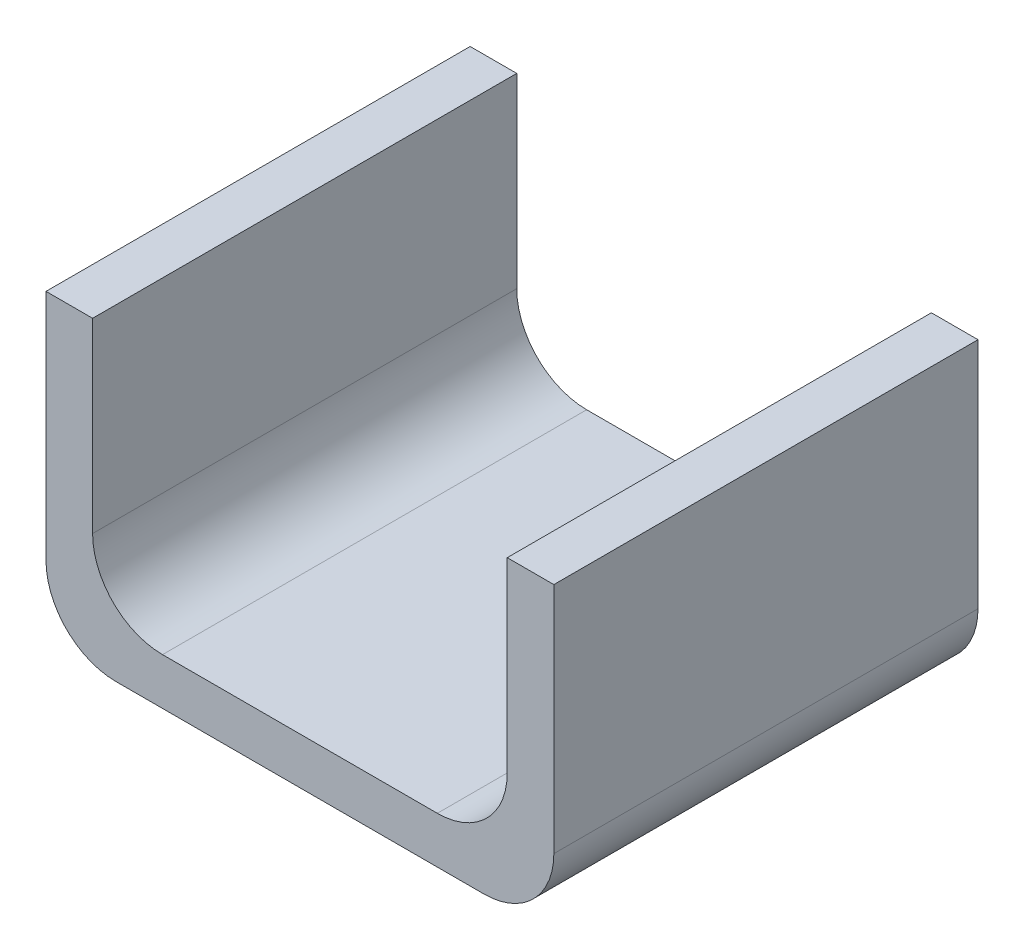
ISO-10303-21;
HEADER;
FILE_DESCRIPTION(('STEP AP214'),'2;1');
FILE_NAME('part.step','',(''),(''),'','','');
FILE_SCHEMA(('AUTOMOTIVE_DESIGN { 1 0 10303 214 1 1 1 1 }'));
ENDSEC;
DATA;
#1=APPLICATION_CONTEXT('core data for automotive mechanical design processes');
#2=APPLICATION_PROTOCOL_DEFINITION('international standard','automotive_design',2000,#1);
#3=PRODUCT_CONTEXT('',#1,'mechanical');
#4=PRODUCT('Part','Part','',(#3));
#5=PRODUCT_RELATED_PRODUCT_CATEGORY('part','',(#4));
#6=PRODUCT_DEFINITION_FORMATION('','',#4);
#7=PRODUCT_DEFINITION_CONTEXT('part definition',#1,'design');
#8=PRODUCT_DEFINITION('design','',#6,#7);
#9=PRODUCT_DEFINITION_SHAPE('','',#8);
#10=(LENGTH_UNIT() NAMED_UNIT(*) SI_UNIT(.MILLI.,.METRE.));
#11=(NAMED_UNIT(*) PLANE_ANGLE_UNIT() SI_UNIT($,.RADIAN.));
#12=(NAMED_UNIT(*) SI_UNIT($,.STERADIAN.) SOLID_ANGLE_UNIT());
#13=UNCERTAINTY_MEASURE_WITH_UNIT(LENGTH_MEASURE(1.E-05),#10,'distance_accuracy_value','');
#14=(GEOMETRIC_REPRESENTATION_CONTEXT(3) GLOBAL_UNCERTAINTY_ASSIGNED_CONTEXT((#13)) GLOBAL_UNIT_ASSIGNED_CONTEXT((#10,
#11,#12)) REPRESENTATION_CONTEXT('',''));
#15=CARTESIAN_POINT('',(0.,0.,0.));
#16=DIRECTION('',(0.,0.,1.));
#17=DIRECTION('',(1.,0.,0.));
#18=AXIS2_PLACEMENT_3D('',#15,#16,#17);
#19=CARTESIAN_POINT('',(0.,2.,0.));
#20=DIRECTION('',(0.,1.,0.));
#21=DIRECTION('',(0.,0.,1.));
#22=AXIS2_PLACEMENT_3D('',#19,#20,#21);
#23=PLANE('',#22);
#24=DIRECTION('',(1.,0.,0.));
#25=VECTOR('',#24,1.);
#26=CARTESIAN_POINT('',(0.,2.,-6.84486778890001));
#27=LINE('',#26,#25);
#28=CARTESIAN_POINT('',(-5.93009682212145,2.,-6.84486778890001));
#29=VERTEX_POINT('',#28);
#30=CARTESIAN_POINT('',(5.86230684431357,2.,-6.84486778890001));
#31=VERTEX_POINT('',#30);
#32=EDGE_CURVE('E173',#29,#31,#27,.T.);
#33=ORIENTED_EDGE('',*,*,#32,.F.);
#34=DIRECTION('',(0.,0.,-1.));
#35=VECTOR('',#34,1.);
#36=CARTESIAN_POINT('',(-5.93009682212145,2.,11.3561660837375));
#37=LINE('',#36,#35);
#38=CARTESIAN_POINT('',(-5.93009682212145,2.,11.3561660837375));
#39=VERTEX_POINT('',#38);
#40=EDGE_CURVE('E214',#29,#39,#37,.F.);
#41=ORIENTED_EDGE('',*,*,#40,.T.);
#42=DIRECTION('',(1.,0.,0.));
#43=VECTOR('',#42,1.);
#44=CARTESIAN_POINT('',(0.,2.,11.3561660837375));
#45=LINE('',#44,#43);
#46=CARTESIAN_POINT('',(5.86230684431357,2.,11.3561660837375));
#47=VERTEX_POINT('',#46);
#48=EDGE_CURVE('E170',#39,#47,#45,.T.);
#49=ORIENTED_EDGE('',*,*,#48,.T.);
#50=DIRECTION('',(0.,0.,-1.));
#51=VECTOR('',#50,1.);
#52=CARTESIAN_POINT('',(5.86230684431357,2.,0.));
#53=LINE('',#52,#51);
#54=EDGE_CURVE('E212',#47,#31,#53,.T.);
#55=ORIENTED_EDGE('',*,*,#54,.T.);
#56=EDGE_LOOP('',(#33,#41,#49,#55));
#57=FACE_BOUND('',#56,.T.);
#58=ADVANCED_FACE('F39',(#57),#23,.T.);
#59=CARTESIAN_POINT('',(0.,2.,11.3561660837375));
#60=DIRECTION('',(0.,0.,-1.));
#61=DIRECTION('',(-1.,0.,0.));
#62=AXIS2_PLACEMENT_3D('',#59,#60,#61);
#63=PLANE('',#62);
#64=DIRECTION('',(0.,-1.,0.));
#65=VECTOR('',#64,1.);
#66=CARTESIAN_POINT('',(-10.9300968221214,2.,11.3561660837375));
#67=LINE('',#66,#65);
#68=CARTESIAN_POINT('',(-10.9300968221214,13.,11.3561660837375));
#69=VERTEX_POINT('',#68);
#70=CARTESIAN_POINT('',(-10.9300968221214,3.,11.3561660837375));
#71=VERTEX_POINT('',#70);
#72=EDGE_CURVE('E176',#69,#71,#67,.T.);
#73=ORIENTED_EDGE('',*,*,#72,.T.);
#74=CARTESIAN_POINT('',(-7.93009682212144,3.,11.3561660837375));
#75=DIRECTION('',(0.,0.,-1.));
#76=DIRECTION('',(-1.,0.,0.));
#77=AXIS2_PLACEMENT_3D('',#74,#75,#76);
#78=CIRCLE('',#77,3.);
#79=CARTESIAN_POINT('',(-7.93009682212144,0.,11.3561660837375));
#80=VERTEX_POINT('',#79);
#81=EDGE_CURVE('E196',#71,#80,#78,.F.);
#82=ORIENTED_EDGE('',*,*,#81,.T.);
#83=DIRECTION('',(1.,0.,0.));
#84=VECTOR('',#83,1.);
#85=CARTESIAN_POINT('',(0.,0.,11.3561660837375));
#86=LINE('',#85,#84);
#87=CARTESIAN_POINT('',(7.86230684431357,0.,11.3561660837375));
#88=VERTEX_POINT('',#87);
#89=EDGE_CURVE('E169',#80,#88,#86,.T.);
#90=ORIENTED_EDGE('',*,*,#89,.T.);
#91=CARTESIAN_POINT('',(7.86230684431357,3.,11.3561660837375));
#92=DIRECTION('',(0.,0.,-1.));
#93=DIRECTION('',(-1.,0.,0.));
#94=AXIS2_PLACEMENT_3D('',#91,#92,#93);
#95=CIRCLE('',#94,3.);
#96=CARTESIAN_POINT('',(10.8623068443136,3.,11.3561660837375));
#97=VERTEX_POINT('',#96);
#98=EDGE_CURVE('E194',#88,#97,#95,.F.);
#99=ORIENTED_EDGE('',*,*,#98,.T.);
#100=DIRECTION('',(0.,-1.,0.));
#101=VECTOR('',#100,1.);
#102=CARTESIAN_POINT('',(10.8623068443136,2.,11.3561660837375));
#103=LINE('',#102,#101);
#104=CARTESIAN_POINT('',(10.8623068443136,13.,11.3561660837375));
#105=VERTEX_POINT('',#104);
#106=EDGE_CURVE('E188',#105,#97,#103,.T.);
#107=ORIENTED_EDGE('',*,*,#106,.F.);
#108=DIRECTION('',(1.,0.,0.));
#109=VECTOR('',#108,1.);
#110=CARTESIAN_POINT('',(0.,13.,11.3561660837375));
#111=LINE('',#110,#109);
#112=CARTESIAN_POINT('',(8.86230684431357,13.,11.3561660837375));
#113=VERTEX_POINT('',#112);
#114=EDGE_CURVE('E143',#113,#105,#111,.T.);
#115=ORIENTED_EDGE('',*,*,#114,.F.);
#116=DIRECTION('',(0.,-1.,0.));
#117=VECTOR('',#116,1.);
#118=CARTESIAN_POINT('',(8.86230684431357,13.,11.3561660837375));
#119=LINE('',#118,#117);
#120=CARTESIAN_POINT('',(8.86230684431357,5.,11.3561660837375));
#121=VERTEX_POINT('',#120);
#122=EDGE_CURVE('E134',#113,#121,#119,.T.);
#123=ORIENTED_EDGE('',*,*,#122,.T.);
#124=CARTESIAN_POINT('',(5.86230684431357,5.,11.3561660837375));
#125=DIRECTION('',(0.,0.,-1.));
#126=DIRECTION('',(-1.,0.,0.));
#127=AXIS2_PLACEMENT_3D('',#124,#125,#126);
#128=CIRCLE('',#127,3.);
#129=EDGE_CURVE('E11',#121,#47,#128,.T.);
#130=ORIENTED_EDGE('',*,*,#129,.T.);
#131=ORIENTED_EDGE('',*,*,#48,.F.);
#132=CARTESIAN_POINT('',(-5.93009682212145,5.,11.3561660837375));
#133=DIRECTION('',(0.,0.,-1.));
#134=DIRECTION('',(-1.,0.,0.));
#135=AXIS2_PLACEMENT_3D('',#132,#133,#134);
#136=CIRCLE('',#135,3.);
#137=CARTESIAN_POINT('',(-8.93009682212144,5.,11.3561660837375));
#138=VERTEX_POINT('',#137);
#139=EDGE_CURVE('E220',#39,#138,#136,.T.);
#140=ORIENTED_EDGE('',*,*,#139,.T.);
#141=DIRECTION('',(0.,-1.,0.));
#142=VECTOR('',#141,1.);
#143=CARTESIAN_POINT('',(-8.93009682212144,13.,11.3561660837375));
#144=LINE('',#143,#142);
#145=CARTESIAN_POINT('',(-8.93009682212144,13.,11.3561660837375));
#146=VERTEX_POINT('',#145);
#147=EDGE_CURVE('E166',#146,#138,#144,.T.);
#148=ORIENTED_EDGE('',*,*,#147,.F.);
#149=DIRECTION('',(1.,0.,0.));
#150=VECTOR('',#149,1.);
#151=CARTESIAN_POINT('',(0.,13.,11.3561660837375));
#152=LINE('',#151,#150);
#153=EDGE_CURVE('E155',#69,#146,#152,.T.);
#154=ORIENTED_EDGE('',*,*,#153,.F.);
#155=EDGE_LOOP('',(#73,#82,#90,#99,#107,#115,#123,#130,#131,#140,#148,#154));
#156=FACE_BOUND('',#155,.T.);
#157=ADVANCED_FACE('F225',(#156),#63,.F.);
#158=CARTESIAN_POINT('',(10.8623068443136,2.,0.));
#159=DIRECTION('',(1.,0.,0.));
#160=DIRECTION('',(0.,0.,-1.));
#161=AXIS2_PLACEMENT_3D('',#158,#159,#160);
#162=PLANE('',#161);
#163=ORIENTED_EDGE('',*,*,#106,.T.);
#164=DIRECTION('',(0.,0.,1.));
#165=VECTOR('',#164,1.);
#166=CARTESIAN_POINT('',(10.8623068443136,3.,-6.84486778890001));
#167=LINE('',#166,#165);
#168=CARTESIAN_POINT('',(10.8623068443136,3.,-6.84486778890001));
#169=VERTEX_POINT('',#168);
#170=EDGE_CURVE('E207',#97,#169,#167,.F.);
#171=ORIENTED_EDGE('',*,*,#170,.T.);
#172=DIRECTION('',(0.,-1.,0.));
#173=VECTOR('',#172,1.);
#174=CARTESIAN_POINT('',(10.8623068443136,2.,-6.84486778890001));
#175=LINE('',#174,#173);
#176=CARTESIAN_POINT('',(10.8623068443136,13.,-6.84486778890001));
#177=VERTEX_POINT('',#176);
#178=EDGE_CURVE('E186',#177,#169,#175,.T.);
#179=ORIENTED_EDGE('',*,*,#178,.F.);
#180=DIRECTION('',(0.,0.,1.));
#181=VECTOR('',#180,1.);
#182=CARTESIAN_POINT('',(10.8623068443136,13.,0.));
#183=LINE('',#182,#181);
#184=EDGE_CURVE('E147',#177,#105,#183,.T.);
#185=ORIENTED_EDGE('',*,*,#184,.T.);
#186=EDGE_LOOP('',(#163,#171,#179,#185));
#187=FACE_BOUND('',#186,.T.);
#188=ADVANCED_FACE('F238',(#187),#162,.T.);
#189=CARTESIAN_POINT('',(0.,2.,-6.84486778890001));
#190=DIRECTION('',(0.,0.,-1.));
#191=DIRECTION('',(-1.,0.,0.));
#192=AXIS2_PLACEMENT_3D('',#189,#190,#191);
#193=PLANE('',#192);
#194=DIRECTION('',(1.,0.,0.));
#195=VECTOR('',#194,1.);
#196=CARTESIAN_POINT('',(0.,0.,-6.84486778890001));
#197=LINE('',#196,#195);
#198=CARTESIAN_POINT('',(-7.93009682212144,0.,-6.84486778890001));
#199=VERTEX_POINT('',#198);
#200=CARTESIAN_POINT('',(7.86230684431357,0.,-6.84486778890001));
#201=VERTEX_POINT('',#200);
#202=EDGE_CURVE('E174',#199,#201,#197,.T.);
#203=ORIENTED_EDGE('',*,*,#202,.F.);
#204=CARTESIAN_POINT('',(-7.93009682212144,3.,-6.84486778890001));
#205=DIRECTION('',(0.,0.,-1.));
#206=DIRECTION('',(-1.,0.,0.));
#207=AXIS2_PLACEMENT_3D('',#204,#205,#206);
#208=CIRCLE('',#207,3.);
#209=CARTESIAN_POINT('',(-10.9300968221214,3.,-6.84486778890001));
#210=VERTEX_POINT('',#209);
#211=EDGE_CURVE('E205',#199,#210,#208,.T.);
#212=ORIENTED_EDGE('',*,*,#211,.T.);
#213=DIRECTION('',(0.,-1.,0.));
#214=VECTOR('',#213,1.);
#215=CARTESIAN_POINT('',(-10.9300968221214,2.,-6.84486778890001));
#216=LINE('',#215,#214);
#217=CARTESIAN_POINT('',(-10.9300968221214,13.,-6.84486778890001));
#218=VERTEX_POINT('',#217);
#219=EDGE_CURVE('E183',#218,#210,#216,.T.);
#220=ORIENTED_EDGE('',*,*,#219,.F.);
#221=DIRECTION('',(1.,0.,0.));
#222=VECTOR('',#221,1.);
#223=CARTESIAN_POINT('',(0.,13.,-6.84486778890001));
#224=LINE('',#223,#222);
#225=CARTESIAN_POINT('',(-8.93009682212145,13.,-6.84486778890001));
#226=VERTEX_POINT('',#225);
#227=EDGE_CURVE('E160',#218,#226,#224,.T.);
#228=ORIENTED_EDGE('',*,*,#227,.T.);
#229=DIRECTION('',(0.,-1.,0.));
#230=VECTOR('',#229,1.);
#231=CARTESIAN_POINT('',(-8.93009682212145,13.,-6.84486778890001));
#232=LINE('',#231,#230);
#233=CARTESIAN_POINT('',(-8.93009682212145,5.,-6.84486778890001));
#234=VERTEX_POINT('',#233);
#235=EDGE_CURVE('E163',#226,#234,#232,.T.);
#236=ORIENTED_EDGE('',*,*,#235,.T.);
#237=CARTESIAN_POINT('',(-5.93009682212145,5.,-6.84486778890001));
#238=DIRECTION('',(0.,0.,-1.));
#239=DIRECTION('',(-1.,0.,0.));
#240=AXIS2_PLACEMENT_3D('',#237,#238,#239);
#241=CIRCLE('',#240,3.);
#242=EDGE_CURVE('E218',#234,#29,#241,.F.);
#243=ORIENTED_EDGE('',*,*,#242,.T.);
#244=ORIENTED_EDGE('',*,*,#32,.T.);
#245=CARTESIAN_POINT('',(5.86230684431357,5.,-6.84486778890001));
#246=DIRECTION('',(0.,0.,-1.));
#247=DIRECTION('',(-1.,0.,0.));
#248=AXIS2_PLACEMENT_3D('',#245,#246,#247);
#249=CIRCLE('',#248,3.);
#250=CARTESIAN_POINT('',(8.86230684431357,5.,-6.84486778890001));
#251=VERTEX_POINT('',#250);
#252=EDGE_CURVE('E47',#31,#251,#249,.F.);
#253=ORIENTED_EDGE('',*,*,#252,.T.);
#254=DIRECTION('',(0.,-1.,0.));
#255=VECTOR('',#254,1.);
#256=CARTESIAN_POINT('',(8.86230684431357,13.,-6.84486778890001));
#257=LINE('',#256,#255);
#258=CARTESIAN_POINT('',(8.86230684431357,13.,-6.84486778890001));
#259=VERTEX_POINT('',#258);
#260=EDGE_CURVE('E124',#259,#251,#257,.T.);
#261=ORIENTED_EDGE('',*,*,#260,.F.);
#262=DIRECTION('',(1.,0.,0.));
#263=VECTOR('',#262,1.);
#264=CARTESIAN_POINT('',(0.,13.,-6.84486778890001));
#265=LINE('',#264,#263);
#266=EDGE_CURVE('E130',#259,#177,#265,.T.);
#267=ORIENTED_EDGE('',*,*,#266,.T.);
#268=ORIENTED_EDGE('',*,*,#178,.T.);
#269=CARTESIAN_POINT('',(7.86230684431357,3.,-6.84486778890001));
#270=DIRECTION('',(0.,0.,-1.));
#271=DIRECTION('',(-1.,0.,0.));
#272=AXIS2_PLACEMENT_3D('',#269,#270,#271);
#273=CIRCLE('',#272,3.);
#274=EDGE_CURVE('E203',#169,#201,#273,.T.);
#275=ORIENTED_EDGE('',*,*,#274,.T.);
#276=EDGE_LOOP('',(#203,#212,#220,#228,#236,#243,#244,#253,#261,#267,#268,#275));
#277=FACE_BOUND('',#276,.T.);
#278=ADVANCED_FACE('F127',(#277),#193,.T.);
#279=CARTESIAN_POINT('',(-10.9300968221214,2.,0.));
#280=DIRECTION('',(1.,0.,0.));
#281=DIRECTION('',(0.,0.,-1.));
#282=AXIS2_PLACEMENT_3D('',#279,#280,#281);
#283=PLANE('',#282);
#284=ORIENTED_EDGE('',*,*,#219,.T.);
#285=DIRECTION('',(0.,0.,1.));
#286=VECTOR('',#285,1.);
#287=CARTESIAN_POINT('',(-10.9300968221214,3.,0.));
#288=LINE('',#287,#286);
#289=EDGE_CURVE('E191',#210,#71,#288,.T.);
#290=ORIENTED_EDGE('',*,*,#289,.T.);
#291=ORIENTED_EDGE('',*,*,#72,.F.);
#292=DIRECTION('',(0.,0.,1.));
#293=VECTOR('',#292,1.);
#294=CARTESIAN_POINT('',(-10.9300968221214,13.,0.));
#295=LINE('',#294,#293);
#296=EDGE_CURVE('E133',#218,#69,#295,.T.);
#297=ORIENTED_EDGE('',*,*,#296,.F.);
#298=EDGE_LOOP('',(#284,#290,#291,#297));
#299=FACE_BOUND('',#298,.T.);
#300=ADVANCED_FACE('F253',(#299),#283,.F.);
#301=CARTESIAN_POINT('',(0.,0.,0.));
#302=DIRECTION('',(0.,1.,0.));
#303=DIRECTION('',(0.,0.,1.));
#304=AXIS2_PLACEMENT_3D('',#301,#302,#303);
#305=PLANE('',#304);
#306=ORIENTED_EDGE('',*,*,#89,.F.);
#307=DIRECTION('',(0.,0.,1.));
#308=VECTOR('',#307,1.);
#309=CARTESIAN_POINT('',(-7.93009682212144,0.,0.));
#310=LINE('',#309,#308);
#311=EDGE_CURVE('E201',#80,#199,#310,.F.);
#312=ORIENTED_EDGE('',*,*,#311,.T.);
#313=ORIENTED_EDGE('',*,*,#202,.T.);
#314=DIRECTION('',(0.,0.,1.));
#315=VECTOR('',#314,1.);
#316=CARTESIAN_POINT('',(7.86230684431357,0.,11.3561660837375));
#317=LINE('',#316,#315);
#318=EDGE_CURVE('E198',#201,#88,#317,.T.);
#319=ORIENTED_EDGE('',*,*,#318,.T.);
#320=EDGE_LOOP('',(#306,#312,#313,#319));
#321=FACE_BOUND('',#320,.T.);
#322=ADVANCED_FACE('F246',(#321),#305,.F.);
#323=CARTESIAN_POINT('',(-8.93009682212145,13.,0.));
#324=DIRECTION('',(1.,0.,0.));
#325=DIRECTION('',(0.,0.,-1.));
#326=AXIS2_PLACEMENT_3D('',#323,#324,#325);
#327=PLANE('',#326);
#328=ORIENTED_EDGE('',*,*,#147,.T.);
#329=DIRECTION('',(0.,0.,-1.));
#330=VECTOR('',#329,1.);
#331=CARTESIAN_POINT('',(-8.93009682212145,5.,-6.84486778890001));
#332=LINE('',#331,#330);
#333=EDGE_CURVE('E209',#138,#234,#332,.T.);
#334=ORIENTED_EDGE('',*,*,#333,.T.);
#335=ORIENTED_EDGE('',*,*,#235,.F.);
#336=DIRECTION('',(0.,0.,1.));
#337=VECTOR('',#336,1.);
#338=CARTESIAN_POINT('',(-8.93009682212145,13.,0.));
#339=LINE('',#338,#337);
#340=EDGE_CURVE('E157',#226,#146,#339,.T.);
#341=ORIENTED_EDGE('',*,*,#340,.T.);
#342=EDGE_LOOP('',(#328,#334,#335,#341));
#343=FACE_BOUND('',#342,.T.);
#344=ADVANCED_FACE('F231',(#343),#327,.T.);
#345=CARTESIAN_POINT('',(0.,13.,0.));
#346=DIRECTION('',(0.,1.,0.));
#347=DIRECTION('',(0.,0.,1.));
#348=AXIS2_PLACEMENT_3D('',#345,#346,#347);
#349=PLANE('',#348);
#350=ORIENTED_EDGE('',*,*,#296,.T.);
#351=ORIENTED_EDGE('',*,*,#153,.T.);
#352=ORIENTED_EDGE('',*,*,#340,.F.);
#353=ORIENTED_EDGE('',*,*,#227,.F.);
#354=EDGE_LOOP('',(#350,#351,#352,#353));
#355=FACE_BOUND('',#354,.T.);
#356=ADVANCED_FACE('F257',(#355),#349,.T.);
#357=CARTESIAN_POINT('',(8.86230684431357,13.,0.));
#358=DIRECTION('',(1.,0.,0.));
#359=DIRECTION('',(0.,0.,-1.));
#360=AXIS2_PLACEMENT_3D('',#357,#358,#359);
#361=PLANE('',#360);
#362=ORIENTED_EDGE('',*,*,#260,.T.);
#363=DIRECTION('',(0.,0.,-1.));
#364=VECTOR('',#363,1.);
#365=CARTESIAN_POINT('',(8.86230684431357,5.,0.));
#366=LINE('',#365,#364);
#367=EDGE_CURVE('E216',#251,#121,#366,.F.);
#368=ORIENTED_EDGE('',*,*,#367,.T.);
#369=ORIENTED_EDGE('',*,*,#122,.F.);
#370=DIRECTION('',(0.,0.,1.));
#371=VECTOR('',#370,1.);
#372=CARTESIAN_POINT('',(8.86230684431357,13.,0.));
#373=LINE('',#372,#371);
#374=EDGE_CURVE('E137',#259,#113,#373,.T.);
#375=ORIENTED_EDGE('',*,*,#374,.F.);
#376=EDGE_LOOP('',(#362,#368,#369,#375));
#377=FACE_BOUND('',#376,.T.);
#378=ADVANCED_FACE('F138',(#377),#361,.F.);
#379=CARTESIAN_POINT('',(0.,13.,0.));
#380=DIRECTION('',(0.,1.,0.));
#381=DIRECTION('',(0.,0.,1.));
#382=AXIS2_PLACEMENT_3D('',#379,#380,#381);
#383=PLANE('',#382);
#384=ORIENTED_EDGE('',*,*,#266,.F.);
#385=ORIENTED_EDGE('',*,*,#374,.T.);
#386=ORIENTED_EDGE('',*,*,#114,.T.);
#387=ORIENTED_EDGE('',*,*,#184,.F.);
#388=EDGE_LOOP('',(#384,#385,#386,#387));
#389=FACE_BOUND('',#388,.T.);
#390=ADVANCED_FACE('F145',(#389),#383,.T.);
#391=CARTESIAN_POINT('',(-7.93009682212144,3.,0.));
#392=DIRECTION('',(0.,0.,1.));
#393=DIRECTION('',(1.,0.,0.));
#394=AXIS2_PLACEMENT_3D('',#391,#392,#393);
#395=CYLINDRICAL_SURFACE('',#394,3.);
#396=ORIENTED_EDGE('',*,*,#211,.F.);
#397=ORIENTED_EDGE('',*,*,#311,.F.);
#398=ORIENTED_EDGE('',*,*,#81,.F.);
#399=ORIENTED_EDGE('',*,*,#289,.F.);
#400=EDGE_LOOP('',(#396,#397,#398,#399));
#401=FACE_BOUND('',#400,.T.);
#402=ADVANCED_FACE('F251',(#401),#395,.T.);
#403=CARTESIAN_POINT('',(7.86230684431357,3.,0.));
#404=DIRECTION('',(0.,0.,-1.));
#405=DIRECTION('',(-1.,0.,0.));
#406=AXIS2_PLACEMENT_3D('',#403,#404,#405);
#407=CYLINDRICAL_SURFACE('',#406,3.);
#408=ORIENTED_EDGE('',*,*,#274,.F.);
#409=ORIENTED_EDGE('',*,*,#170,.F.);
#410=ORIENTED_EDGE('',*,*,#98,.F.);
#411=ORIENTED_EDGE('',*,*,#318,.F.);
#412=EDGE_LOOP('',(#408,#409,#410,#411));
#413=FACE_BOUND('',#412,.T.);
#414=ADVANCED_FACE('F243',(#413),#407,.T.);
#415=CARTESIAN_POINT('',(-5.93009682212145,5.,0.));
#416=DIRECTION('',(0.,0.,1.));
#417=DIRECTION('',(1.,0.,0.));
#418=AXIS2_PLACEMENT_3D('',#415,#416,#417);
#419=CYLINDRICAL_SURFACE('',#418,3.);
#420=ORIENTED_EDGE('',*,*,#139,.F.);
#421=ORIENTED_EDGE('',*,*,#40,.F.);
#422=ORIENTED_EDGE('',*,*,#242,.F.);
#423=ORIENTED_EDGE('',*,*,#333,.F.);
#424=EDGE_LOOP('',(#420,#421,#422,#423));
#425=FACE_BOUND('',#424,.T.);
#426=ADVANCED_FACE('F233',(#425),#419,.F.);
#427=CARTESIAN_POINT('',(5.86230684431357,5.,0.));
#428=DIRECTION('',(0.,0.,-1.));
#429=DIRECTION('',(-1.,0.,0.));
#430=AXIS2_PLACEMENT_3D('',#427,#428,#429);
#431=CYLINDRICAL_SURFACE('',#430,3.);
#432=ORIENTED_EDGE('',*,*,#129,.F.);
#433=ORIENTED_EDGE('',*,*,#367,.F.);
#434=ORIENTED_EDGE('',*,*,#252,.F.);
#435=ORIENTED_EDGE('',*,*,#54,.F.);
#436=EDGE_LOOP('',(#432,#433,#434,#435));
#437=FACE_BOUND('',#436,.T.);
#438=ADVANCED_FACE('F41',(#437),#431,.F.);
#439=CLOSED_SHELL('',(#58,#157,#188,#278,#300,#322,#344,#356,#378,#390,#402,#414,#426,#438));
#440=MANIFOLD_SOLID_BREP('B2',#439);
#441=ADVANCED_BREP_SHAPE_REPRESENTATION('',(#18,#440),#14);
#442=SHAPE_DEFINITION_REPRESENTATION(#9,#441);
ENDSEC;
END-ISO-10303-21;
